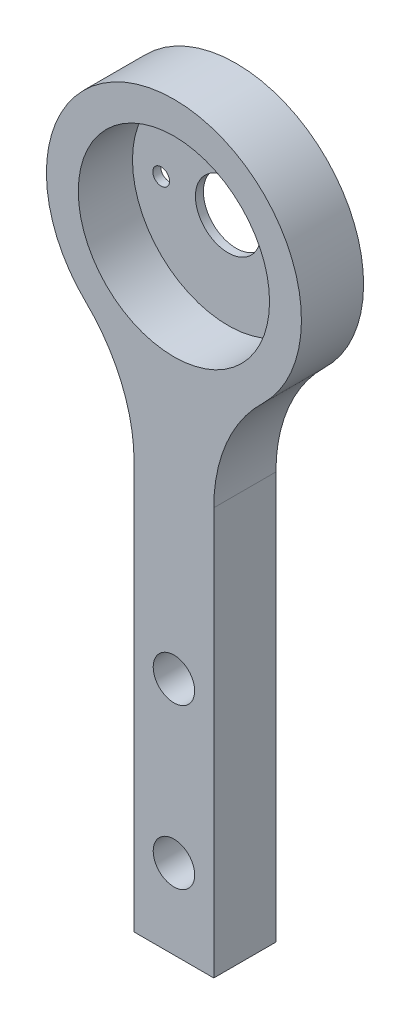
ISO-10303-21;
HEADER;
FILE_DESCRIPTION(('STEP AP214'),'2;1');
FILE_NAME('part.step','',(''),(''),'','','');
FILE_SCHEMA(('AUTOMOTIVE_DESIGN { 1 0 10303 214 1 1 1 1 }'));
ENDSEC;
DATA;
#1=APPLICATION_CONTEXT('core data for automotive mechanical design processes');
#2=APPLICATION_PROTOCOL_DEFINITION('international standard','automotive_design',2000,#1);
#3=PRODUCT_CONTEXT('',#1,'mechanical');
#4=PRODUCT('Part','Part','',(#3));
#5=PRODUCT_RELATED_PRODUCT_CATEGORY('part','',(#4));
#6=PRODUCT_DEFINITION_FORMATION('','',#4);
#7=PRODUCT_DEFINITION_CONTEXT('part definition',#1,'design');
#8=PRODUCT_DEFINITION('design','',#6,#7);
#9=PRODUCT_DEFINITION_SHAPE('','',#8);
#10=(LENGTH_UNIT() NAMED_UNIT(*) SI_UNIT(.MILLI.,.METRE.));
#11=(NAMED_UNIT(*) PLANE_ANGLE_UNIT() SI_UNIT($,.RADIAN.));
#12=(NAMED_UNIT(*) SI_UNIT($,.STERADIAN.) SOLID_ANGLE_UNIT());
#13=UNCERTAINTY_MEASURE_WITH_UNIT(LENGTH_MEASURE(1.E-05),#10,'distance_accuracy_value','');
#14=(GEOMETRIC_REPRESENTATION_CONTEXT(3) GLOBAL_UNCERTAINTY_ASSIGNED_CONTEXT((#13)) GLOBAL_UNIT_ASSIGNED_CONTEXT((#10,
#11,#12)) REPRESENTATION_CONTEXT('',''));
#15=CARTESIAN_POINT('',(0.,0.,0.));
#16=DIRECTION('',(0.,0.,1.));
#17=DIRECTION('',(1.,0.,0.));
#18=AXIS2_PLACEMENT_3D('',#15,#16,#17);
#19=CARTESIAN_POINT('',(0.,0.,3.9));
#20=DIRECTION('',(0.,0.,-1.));
#21=DIRECTION('',(-1.,0.,0.));
#22=AXIS2_PLACEMENT_3D('',#19,#20,#21);
#23=CYLINDRICAL_SURFACE('',#22,6.);
#24=CARTESIAN_POINT('',(0.,0.,3.9));
#25=DIRECTION('',(0.,0.,1.));
#26=DIRECTION('',(1.,0.,0.));
#27=AXIS2_PLACEMENT_3D('',#24,#25,#26);
#28=CIRCLE('',#27,6.);
#29=CARTESIAN_POINT('',(6.,0.,3.9));
#30=VERTEX_POINT('',#29);
#31=EDGE_CURVE('E126',#30,#30,#28,.T.);
#32=ORIENTED_EDGE('',*,*,#31,.T.);
#33=EDGE_LOOP('',(#32));
#34=FACE_BOUND('',#33,.T.);
#35=CARTESIAN_POINT('',(0.,0.,0.5));
#36=DIRECTION('',(0.,0.,-1.));
#37=DIRECTION('',(-1.,0.,0.));
#38=AXIS2_PLACEMENT_3D('',#35,#36,#37);
#39=CIRCLE('',#38,6.);
#40=CARTESIAN_POINT('',(-6.,0.,0.5));
#41=VERTEX_POINT('',#40);
#42=EDGE_CURVE('E40',#41,#41,#39,.T.);
#43=ORIENTED_EDGE('',*,*,#42,.T.);
#44=EDGE_LOOP('',(#43));
#45=FACE_BOUND('',#44,.T.);
#46=ADVANCED_FACE('F36',(#34,#45),#23,.F.);
#47=CARTESIAN_POINT('',(-12.5,-12.9518338469886,3.9));
#48=DIRECTION('',(0.,0.,-1.));
#49=DIRECTION('',(-1.,0.,0.));
#50=AXIS2_PLACEMENT_3D('',#47,#48,#49);
#51=PLANE('',#50);
#52=CARTESIAN_POINT('',(0.,-33.5,3.9));
#53=DIRECTION('',(0.,0.,-1.));
#54=DIRECTION('',(-1.,0.,0.));
#55=AXIS2_PLACEMENT_3D('',#52,#53,#54);
#56=CIRCLE('',#55,1.3);
#57=CARTESIAN_POINT('',(-1.29999999999999,-33.5,3.9));
#58=VERTEX_POINT('',#57);
#59=EDGE_CURVE('E188',#58,#58,#56,.T.);
#60=ORIENTED_EDGE('',*,*,#59,.T.);
#61=EDGE_LOOP('',(#60));
#62=FACE_BOUND('',#61,.T.);
#63=CARTESIAN_POINT('',(0.,-23.5,3.9));
#64=DIRECTION('',(0.,0.,-1.));
#65=DIRECTION('',(-1.,0.,0.));
#66=AXIS2_PLACEMENT_3D('',#63,#64,#65);
#67=CIRCLE('',#66,1.3);
#68=CARTESIAN_POINT('',(-1.29999999999999,-23.5,3.9));
#69=VERTEX_POINT('',#68);
#70=EDGE_CURVE('E191',#69,#69,#67,.T.);
#71=ORIENTED_EDGE('',*,*,#70,.T.);
#72=EDGE_LOOP('',(#71));
#73=FACE_BOUND('',#72,.T.);
#74=DIRECTION('',(0.,1.,0.));
#75=VECTOR('',#74,1.);
#76=CARTESIAN_POINT('',(2.5,-12.9518338469886,3.9));
#77=LINE('',#76,#75);
#78=CARTESIAN_POINT('',(2.5,-38.5,3.9));
#79=VERTEX_POINT('',#78);
#80=CARTESIAN_POINT('',(2.5,-12.9518338469886,3.9));
#81=VERTEX_POINT('',#80);
#82=EDGE_CURVE('E135',#79,#81,#77,.T.);
#83=ORIENTED_EDGE('',*,*,#82,.T.);
#84=CARTESIAN_POINT('',(12.5,-12.9518338469886,3.9));
#85=DIRECTION('',(0.,0.,-1.));
#86=DIRECTION('',(1.,0.,0.));
#87=AXIS2_PLACEMENT_3D('',#84,#85,#86);
#88=CIRCLE('',#87,10.);
#89=CARTESIAN_POINT('',(5.55555555555555,-5.75637059866161,3.9));
#90=VERTEX_POINT('',#89);
#91=EDGE_CURVE('E91',#81,#90,#88,.T.);
#92=ORIENTED_EDGE('',*,*,#91,.T.);
#93=CARTESIAN_POINT('',(0.,0.,3.9));
#94=DIRECTION('',(0.,0.,1.));
#95=DIRECTION('',(1.,0.,0.));
#96=AXIS2_PLACEMENT_3D('',#93,#94,#95);
#97=CIRCLE('',#96,8.);
#98=CARTESIAN_POINT('',(-5.55555555555556,-5.75637059866161,3.9));
#99=VERTEX_POINT('',#98);
#100=EDGE_CURVE('E105',#90,#99,#97,.T.);
#101=ORIENTED_EDGE('',*,*,#100,.T.);
#102=CARTESIAN_POINT('',(-12.5,-12.9518338469886,3.9));
#103=DIRECTION('',(0.,0.,-1.));
#104=DIRECTION('',(-1.,0.,0.));
#105=AXIS2_PLACEMENT_3D('',#102,#103,#104);
#106=CIRCLE('',#105,10.);
#107=CARTESIAN_POINT('',(-2.5,-12.9518338469886,3.9));
#108=VERTEX_POINT('',#107);
#109=EDGE_CURVE('E98',#99,#108,#106,.T.);
#110=ORIENTED_EDGE('',*,*,#109,.T.);
#111=DIRECTION('',(0.,-1.,0.));
#112=VECTOR('',#111,1.);
#113=CARTESIAN_POINT('',(-2.5,-12.9518338469886,3.9));
#114=LINE('',#113,#112);
#115=CARTESIAN_POINT('',(-2.5,-38.5,3.9));
#116=VERTEX_POINT('',#115);
#117=EDGE_CURVE('E103',#108,#116,#114,.T.);
#118=ORIENTED_EDGE('',*,*,#117,.T.);
#119=DIRECTION('',(1.,0.,0.));
#120=VECTOR('',#119,1.);
#121=CARTESIAN_POINT('',(-2.5,-38.5,3.9));
#122=LINE('',#121,#120);
#123=EDGE_CURVE('E54',#116,#79,#122,.T.);
#124=ORIENTED_EDGE('',*,*,#123,.T.);
#125=EDGE_LOOP('',(#83,#92,#101,#110,#118,#124));
#126=FACE_BOUND('',#125,.T.);
#127=ORIENTED_EDGE('',*,*,#31,.F.);
#128=EDGE_LOOP('',(#127));
#129=FACE_BOUND('',#128,.T.);
#130=ADVANCED_FACE('F100',(#62,#73,#126,#129),#51,.F.);
#131=CARTESIAN_POINT('',(-12.5,-12.9518338469886,0.));
#132=DIRECTION('',(0.,0.,-1.));
#133=DIRECTION('',(-1.,0.,0.));
#134=AXIS2_PLACEMENT_3D('',#131,#132,#133);
#135=PLANE('',#134);
#136=CARTESIAN_POINT('',(0.,-33.5,0.));
#137=DIRECTION('',(0.,0.,-1.));
#138=DIRECTION('',(-1.,0.,0.));
#139=AXIS2_PLACEMENT_3D('',#136,#137,#138);
#140=CIRCLE('',#139,2.2);
#141=CARTESIAN_POINT('',(-2.19999999999999,-33.5,0.));
#142=VERTEX_POINT('',#141);
#143=EDGE_CURVE('E182',#142,#142,#140,.T.);
#144=ORIENTED_EDGE('',*,*,#143,.F.);
#145=EDGE_LOOP('',(#144));
#146=FACE_BOUND('',#145,.T.);
#147=CARTESIAN_POINT('',(0.,-23.5,0.));
#148=DIRECTION('',(0.,0.,-1.));
#149=DIRECTION('',(-1.,0.,0.));
#150=AXIS2_PLACEMENT_3D('',#147,#148,#149);
#151=CIRCLE('',#150,2.2);
#152=CARTESIAN_POINT('',(-2.2,-23.5,0.));
#153=VERTEX_POINT('',#152);
#154=EDGE_CURVE('E185',#153,#153,#151,.T.);
#155=ORIENTED_EDGE('',*,*,#154,.F.);
#156=EDGE_LOOP('',(#155));
#157=FACE_BOUND('',#156,.T.);
#158=CARTESIAN_POINT('',(-12.5,-12.9518338469886,0.));
#159=DIRECTION('',(0.,0.,-1.));
#160=DIRECTION('',(-1.,0.,0.));
#161=AXIS2_PLACEMENT_3D('',#158,#159,#160);
#162=CIRCLE('',#161,10.);
#163=CARTESIAN_POINT('',(-5.55555555555556,-5.75637059866161,0.));
#164=VERTEX_POINT('',#163);
#165=CARTESIAN_POINT('',(-2.5,-12.9518338469886,0.));
#166=VERTEX_POINT('',#165);
#167=EDGE_CURVE('E112',#164,#166,#162,.T.);
#168=ORIENTED_EDGE('',*,*,#167,.F.);
#169=CARTESIAN_POINT('',(0.,0.,0.));
#170=DIRECTION('',(0.,0.,1.));
#171=DIRECTION('',(1.,0.,0.));
#172=AXIS2_PLACEMENT_3D('',#169,#170,#171);
#173=CIRCLE('',#172,8.);
#174=CARTESIAN_POINT('',(5.55555555555555,-5.75637059866161,0.));
#175=VERTEX_POINT('',#174);
#176=EDGE_CURVE('E129',#175,#164,#173,.T.);
#177=ORIENTED_EDGE('',*,*,#176,.F.);
#178=CARTESIAN_POINT('',(12.5,-12.9518338469886,0.));
#179=DIRECTION('',(0.,0.,-1.));
#180=DIRECTION('',(1.,0.,0.));
#181=AXIS2_PLACEMENT_3D('',#178,#179,#180);
#182=CIRCLE('',#181,10.);
#183=CARTESIAN_POINT('',(2.5,-12.9518338469886,0.));
#184=VERTEX_POINT('',#183);
#185=EDGE_CURVE('E125',#184,#175,#182,.T.);
#186=ORIENTED_EDGE('',*,*,#185,.F.);
#187=DIRECTION('',(0.,1.,0.));
#188=VECTOR('',#187,1.);
#189=CARTESIAN_POINT('',(2.5,-12.9518338469886,0.));
#190=LINE('',#189,#188);
#191=CARTESIAN_POINT('',(2.5,-38.5,0.));
#192=VERTEX_POINT('',#191);
#193=EDGE_CURVE('E122',#192,#184,#190,.T.);
#194=ORIENTED_EDGE('',*,*,#193,.F.);
#195=DIRECTION('',(1.,0.,0.));
#196=VECTOR('',#195,1.);
#197=CARTESIAN_POINT('',(-2.5,-38.5,0.));
#198=LINE('',#197,#196);
#199=CARTESIAN_POINT('',(-2.5,-38.5,0.));
#200=VERTEX_POINT('',#199);
#201=EDGE_CURVE('E83',#200,#192,#198,.T.);
#202=ORIENTED_EDGE('',*,*,#201,.F.);
#203=DIRECTION('',(0.,-1.,0.));
#204=VECTOR('',#203,1.);
#205=CARTESIAN_POINT('',(-2.5,-12.9518338469886,0.));
#206=LINE('',#205,#204);
#207=EDGE_CURVE('E77',#166,#200,#206,.T.);
#208=ORIENTED_EDGE('',*,*,#207,.F.);
#209=EDGE_LOOP('',(#168,#177,#186,#194,#202,#208));
#210=FACE_BOUND('',#209,.T.);
#211=CARTESIAN_POINT('',(0.,0.,0.));
#212=DIRECTION('',(0.,0.,-1.));
#213=DIRECTION('',(-1.,0.,0.));
#214=AXIS2_PLACEMENT_3D('',#211,#212,#213);
#215=CIRCLE('',#214,2.05);
#216=CARTESIAN_POINT('',(-2.05,0.,0.));
#217=VERTEX_POINT('',#216);
#218=EDGE_CURVE('E210',#217,#217,#215,.T.);
#219=ORIENTED_EDGE('',*,*,#218,.F.);
#220=EDGE_LOOP('',(#219));
#221=FACE_BOUND('',#220,.T.);
#222=CARTESIAN_POINT('',(-4.2,0.,0.));
#223=DIRECTION('',(0.,0.,-1.));
#224=DIRECTION('',(-1.,0.,0.));
#225=AXIS2_PLACEMENT_3D('',#222,#223,#224);
#226=CIRCLE('',#225,0.525);
#227=CARTESIAN_POINT('',(-4.725,0.,0.));
#228=VERTEX_POINT('',#227);
#229=EDGE_CURVE('E204',#228,#228,#226,.T.);
#230=ORIENTED_EDGE('',*,*,#229,.F.);
#231=EDGE_LOOP('',(#230));
#232=FACE_BOUND('',#231,.T.);
#233=CARTESIAN_POINT('',(4.2,0.,0.));
#234=DIRECTION('',(0.,0.,-1.));
#235=DIRECTION('',(-1.,0.,0.));
#236=AXIS2_PLACEMENT_3D('',#233,#234,#235);
#237=CIRCLE('',#236,0.525);
#238=CARTESIAN_POINT('',(3.675,0.,0.));
#239=VERTEX_POINT('',#238);
#240=EDGE_CURVE('E200',#239,#239,#237,.T.);
#241=ORIENTED_EDGE('',*,*,#240,.F.);
#242=EDGE_LOOP('',(#241));
#243=FACE_BOUND('',#242,.T.);
#244=ADVANCED_FACE('F146',(#146,#157,#210,#221,#232,#243),#135,.T.);
#245=CARTESIAN_POINT('',(2.5,-12.9518338469886,3.9));
#246=DIRECTION('',(-1.,0.,0.));
#247=DIRECTION('',(0.,-1.,0.));
#248=AXIS2_PLACEMENT_3D('',#245,#246,#247);
#249=PLANE('',#248);
#250=ORIENTED_EDGE('',*,*,#193,.T.);
#251=DIRECTION('',(0.,0.,-1.));
#252=VECTOR('',#251,1.);
#253=CARTESIAN_POINT('',(2.5,-12.9518338469886,3.9));
#254=LINE('',#253,#252);
#255=EDGE_CURVE('E11',#81,#184,#254,.T.);
#256=ORIENTED_EDGE('',*,*,#255,.F.);
#257=ORIENTED_EDGE('',*,*,#82,.F.);
#258=DIRECTION('',(0.,0.,-1.));
#259=VECTOR('',#258,1.);
#260=CARTESIAN_POINT('',(2.5,-38.5,3.9));
#261=LINE('',#260,#259);
#262=EDGE_CURVE('E118',#79,#192,#261,.T.);
#263=ORIENTED_EDGE('',*,*,#262,.T.);
#264=EDGE_LOOP('',(#250,#256,#257,#263));
#265=FACE_BOUND('',#264,.T.);
#266=ADVANCED_FACE('F38',(#265),#249,.F.);
#267=CARTESIAN_POINT('',(12.5,-12.9518338469886,3.9));
#268=DIRECTION('',(0.,0.,-1.));
#269=DIRECTION('',(-1.,0.,0.));
#270=AXIS2_PLACEMENT_3D('',#267,#268,#269);
#271=CYLINDRICAL_SURFACE('',#270,10.);
#272=ORIENTED_EDGE('',*,*,#185,.T.);
#273=DIRECTION('',(0.,0.,-1.));
#274=VECTOR('',#273,1.);
#275=CARTESIAN_POINT('',(5.55555555555555,-5.75637059866161,3.9));
#276=LINE('',#275,#274);
#277=EDGE_CURVE('E46',#90,#175,#276,.T.);
#278=ORIENTED_EDGE('',*,*,#277,.F.);
#279=ORIENTED_EDGE('',*,*,#91,.F.);
#280=ORIENTED_EDGE('',*,*,#255,.T.);
#281=EDGE_LOOP('',(#272,#278,#279,#280));
#282=FACE_BOUND('',#281,.T.);
#283=ADVANCED_FACE('F142',(#282),#271,.F.);
#284=CARTESIAN_POINT('',(0.,0.,3.9));
#285=DIRECTION('',(0.,0.,-1.));
#286=DIRECTION('',(-1.,0.,0.));
#287=AXIS2_PLACEMENT_3D('',#284,#285,#286);
#288=CYLINDRICAL_SURFACE('',#287,8.);
#289=ORIENTED_EDGE('',*,*,#176,.T.);
#290=DIRECTION('',(0.,0.,-1.));
#291=VECTOR('',#290,1.);
#292=CARTESIAN_POINT('',(-5.55555555555556,-5.75637059866161,3.9));
#293=LINE('',#292,#291);
#294=EDGE_CURVE('E113',#99,#164,#293,.T.);
#295=ORIENTED_EDGE('',*,*,#294,.F.);
#296=ORIENTED_EDGE('',*,*,#100,.F.);
#297=ORIENTED_EDGE('',*,*,#277,.T.);
#298=EDGE_LOOP('',(#289,#295,#296,#297));
#299=FACE_BOUND('',#298,.T.);
#300=ADVANCED_FACE('F140',(#299),#288,.T.);
#301=CARTESIAN_POINT('',(-12.5,-12.9518338469886,3.9));
#302=DIRECTION('',(0.,0.,-1.));
#303=DIRECTION('',(-1.,0.,0.));
#304=AXIS2_PLACEMENT_3D('',#301,#302,#303);
#305=CYLINDRICAL_SURFACE('',#304,10.);
#306=ORIENTED_EDGE('',*,*,#167,.T.);
#307=DIRECTION('',(0.,0.,-1.));
#308=VECTOR('',#307,1.);
#309=CARTESIAN_POINT('',(-2.5,-12.9518338469886,3.9));
#310=LINE('',#309,#308);
#311=EDGE_CURVE('E109',#108,#166,#310,.T.);
#312=ORIENTED_EDGE('',*,*,#311,.F.);
#313=ORIENTED_EDGE('',*,*,#109,.F.);
#314=ORIENTED_EDGE('',*,*,#294,.T.);
#315=EDGE_LOOP('',(#306,#312,#313,#314));
#316=FACE_BOUND('',#315,.T.);
#317=ADVANCED_FACE('F110',(#316),#305,.F.);
#318=CARTESIAN_POINT('',(-2.5,-12.9518338469886,3.9));
#319=DIRECTION('',(1.,0.,0.));
#320=DIRECTION('',(0.,1.,0.));
#321=AXIS2_PLACEMENT_3D('',#318,#319,#320);
#322=PLANE('',#321);
#323=ORIENTED_EDGE('',*,*,#207,.T.);
#324=DIRECTION('',(0.,0.,-1.));
#325=VECTOR('',#324,1.);
#326=CARTESIAN_POINT('',(-2.5,-38.5,3.9));
#327=LINE('',#326,#325);
#328=EDGE_CURVE('E114',#116,#200,#327,.T.);
#329=ORIENTED_EDGE('',*,*,#328,.F.);
#330=ORIENTED_EDGE('',*,*,#117,.F.);
#331=ORIENTED_EDGE('',*,*,#311,.T.);
#332=EDGE_LOOP('',(#323,#329,#330,#331));
#333=FACE_BOUND('',#332,.T.);
#334=ADVANCED_FACE('F116',(#333),#322,.F.);
#335=CARTESIAN_POINT('',(-2.5,-38.5,3.9));
#336=DIRECTION('',(0.,1.,0.));
#337=DIRECTION('',(0.,0.,1.));
#338=AXIS2_PLACEMENT_3D('',#335,#336,#337);
#339=PLANE('',#338);
#340=ORIENTED_EDGE('',*,*,#201,.T.);
#341=ORIENTED_EDGE('',*,*,#262,.F.);
#342=ORIENTED_EDGE('',*,*,#123,.F.);
#343=ORIENTED_EDGE('',*,*,#328,.T.);
#344=EDGE_LOOP('',(#340,#341,#342,#343));
#345=FACE_BOUND('',#344,.T.);
#346=ADVANCED_FACE('F150',(#345),#339,.F.);
#347=CARTESIAN_POINT('',(0.,0.,0.5));
#348=DIRECTION('',(0.,0.,-1.));
#349=DIRECTION('',(-1.,0.,0.));
#350=AXIS2_PLACEMENT_3D('',#347,#348,#349);
#351=PLANE('',#350);
#352=CARTESIAN_POINT('',(0.,0.,0.5));
#353=DIRECTION('',(0.,0.,-1.));
#354=DIRECTION('',(-1.,0.,0.));
#355=AXIS2_PLACEMENT_3D('',#352,#353,#354);
#356=CIRCLE('',#355,2.05);
#357=CARTESIAN_POINT('',(-2.05,0.,0.5));
#358=VERTEX_POINT('',#357);
#359=EDGE_CURVE('E213',#358,#358,#356,.T.);
#360=ORIENTED_EDGE('',*,*,#359,.T.);
#361=EDGE_LOOP('',(#360));
#362=FACE_BOUND('',#361,.T.);
#363=CARTESIAN_POINT('',(-4.2,0.,0.5));
#364=DIRECTION('',(0.,0.,-1.));
#365=DIRECTION('',(-1.,0.,0.));
#366=AXIS2_PLACEMENT_3D('',#363,#364,#365);
#367=CIRCLE('',#366,0.525);
#368=CARTESIAN_POINT('',(-4.725,0.,0.5));
#369=VERTEX_POINT('',#368);
#370=EDGE_CURVE('E207',#369,#369,#367,.T.);
#371=ORIENTED_EDGE('',*,*,#370,.T.);
#372=EDGE_LOOP('',(#371));
#373=FACE_BOUND('',#372,.T.);
#374=CARTESIAN_POINT('',(4.2,0.,0.5));
#375=DIRECTION('',(0.,0.,-1.));
#376=DIRECTION('',(-1.,0.,0.));
#377=AXIS2_PLACEMENT_3D('',#374,#375,#376);
#378=CIRCLE('',#377,0.525);
#379=CARTESIAN_POINT('',(3.675,0.,0.5));
#380=VERTEX_POINT('',#379);
#381=EDGE_CURVE('E201',#380,#380,#378,.T.);
#382=ORIENTED_EDGE('',*,*,#381,.T.);
#383=EDGE_LOOP('',(#382));
#384=FACE_BOUND('',#383,.T.);
#385=ORIENTED_EDGE('',*,*,#42,.F.);
#386=EDGE_LOOP('',(#385));
#387=FACE_BOUND('',#386,.T.);
#388=ADVANCED_FACE('F152',(#362,#373,#384,#387),#351,.F.);
#389=CARTESIAN_POINT('',(0.,0.,0.5));
#390=DIRECTION('',(0.,0.,-1.));
#391=DIRECTION('',(-1.,0.,0.));
#392=AXIS2_PLACEMENT_3D('',#389,#390,#391);
#393=CYLINDRICAL_SURFACE('',#392,2.05);
#394=ORIENTED_EDGE('',*,*,#359,.F.);
#395=EDGE_LOOP('',(#394));
#396=FACE_BOUND('',#395,.T.);
#397=ORIENTED_EDGE('',*,*,#218,.T.);
#398=EDGE_LOOP('',(#397));
#399=FACE_BOUND('',#398,.T.);
#400=ADVANCED_FACE('F158',(#396,#399),#393,.F.);
#401=CARTESIAN_POINT('',(-4.2,0.,0.5));
#402=DIRECTION('',(0.,0.,-1.));
#403=DIRECTION('',(-1.,0.,0.));
#404=AXIS2_PLACEMENT_3D('',#401,#402,#403);
#405=CYLINDRICAL_SURFACE('',#404,0.525);
#406=ORIENTED_EDGE('',*,*,#370,.F.);
#407=EDGE_LOOP('',(#406));
#408=FACE_BOUND('',#407,.T.);
#409=ORIENTED_EDGE('',*,*,#229,.T.);
#410=EDGE_LOOP('',(#409));
#411=FACE_BOUND('',#410,.T.);
#412=ADVANCED_FACE('F234',(#408,#411),#405,.F.);
#413=CARTESIAN_POINT('',(4.2,0.,0.5));
#414=DIRECTION('',(0.,0.,-1.));
#415=DIRECTION('',(-1.,0.,0.));
#416=AXIS2_PLACEMENT_3D('',#413,#414,#415);
#417=CYLINDRICAL_SURFACE('',#416,0.525);
#418=ORIENTED_EDGE('',*,*,#381,.F.);
#419=EDGE_LOOP('',(#418));
#420=FACE_BOUND('',#419,.T.);
#421=ORIENTED_EDGE('',*,*,#240,.T.);
#422=EDGE_LOOP('',(#421));
#423=FACE_BOUND('',#422,.T.);
#424=ADVANCED_FACE('F231',(#420,#423),#417,.F.);
#425=CARTESIAN_POINT('',(0.,-23.5,0.));
#426=DIRECTION('',(0.,0.,-1.));
#427=DIRECTION('',(-1.,0.,0.));
#428=AXIS2_PLACEMENT_3D('',#425,#426,#427);
#429=CYLINDRICAL_SURFACE('',#428,1.29999999999999);
#430=ORIENTED_EDGE('',*,*,#70,.F.);
#431=EDGE_LOOP('',(#430));
#432=FACE_BOUND('',#431,.T.);
#433=CARTESIAN_POINT('',(0.,-23.5,0.899999999999998));
#434=DIRECTION('',(0.,0.,-1.));
#435=DIRECTION('',(-1.,0.,0.));
#436=AXIS2_PLACEMENT_3D('',#433,#434,#435);
#437=CIRCLE('',#436,1.29999999999999);
#438=CARTESIAN_POINT('',(-1.29999999999998,-23.5,0.899999999999998));
#439=VERTEX_POINT('',#438);
#440=EDGE_CURVE('E187',#439,#439,#437,.T.);
#441=ORIENTED_EDGE('',*,*,#440,.T.);
#442=EDGE_LOOP('',(#441));
#443=FACE_BOUND('',#442,.T.);
#444=ADVANCED_FACE('F233',(#432,#443),#429,.F.);
#445=CARTESIAN_POINT('',(0.,-23.5,0.));
#446=DIRECTION('',(0.,0.,-1.));
#447=DIRECTION('',(-1.,0.,0.));
#448=AXIS2_PLACEMENT_3D('',#445,#446,#447);
#449=CONICAL_SURFACE('',#448,2.2,0.785398163397455);
#450=ORIENTED_EDGE('',*,*,#440,.F.);
#451=EDGE_LOOP('',(#450));
#452=FACE_BOUND('',#451,.T.);
#453=ORIENTED_EDGE('',*,*,#154,.T.);
#454=EDGE_LOOP('',(#453));
#455=FACE_BOUND('',#454,.T.);
#456=ADVANCED_FACE('F241',(#452,#455),#449,.F.);
#457=CARTESIAN_POINT('',(0.,-33.5,0.));
#458=DIRECTION('',(0.,0.,-1.));
#459=DIRECTION('',(-1.,0.,0.));
#460=AXIS2_PLACEMENT_3D('',#457,#458,#459);
#461=CYLINDRICAL_SURFACE('',#460,1.29999999999999);
#462=ORIENTED_EDGE('',*,*,#59,.F.);
#463=EDGE_LOOP('',(#462));
#464=FACE_BOUND('',#463,.T.);
#465=CARTESIAN_POINT('',(0.,-33.5,0.899999999999998));
#466=DIRECTION('',(0.,0.,-1.));
#467=DIRECTION('',(-1.,0.,0.));
#468=AXIS2_PLACEMENT_3D('',#465,#466,#467);
#469=CIRCLE('',#468,1.29999999999999);
#470=CARTESIAN_POINT('',(-1.29999999999998,-33.5,0.899999999999998));
#471=VERTEX_POINT('',#470);
#472=EDGE_CURVE('E194',#471,#471,#469,.T.);
#473=ORIENTED_EDGE('',*,*,#472,.T.);
#474=EDGE_LOOP('',(#473));
#475=FACE_BOUND('',#474,.T.);
#476=ADVANCED_FACE('F295',(#464,#475),#461,.F.);
#477=CARTESIAN_POINT('',(0.,-33.5,0.));
#478=DIRECTION('',(0.,0.,-1.));
#479=DIRECTION('',(-1.,0.,0.));
#480=AXIS2_PLACEMENT_3D('',#477,#478,#479);
#481=CONICAL_SURFACE('',#480,2.2,0.785398163397455);
#482=ORIENTED_EDGE('',*,*,#472,.F.);
#483=EDGE_LOOP('',(#482));
#484=FACE_BOUND('',#483,.T.);
#485=ORIENTED_EDGE('',*,*,#143,.T.);
#486=EDGE_LOOP('',(#485));
#487=FACE_BOUND('',#486,.T.);
#488=ADVANCED_FACE('F304',(#484,#487),#481,.F.);
#489=CLOSED_SHELL('',(#46,#130,#244,#266,#283,#300,#317,#334,#346,#388,#400,#412,#424,#444,#456,
#476,#488));
#490=MANIFOLD_SOLID_BREP('B2',#489);
#491=ADVANCED_BREP_SHAPE_REPRESENTATION('',(#18,#490),#14);
#492=SHAPE_DEFINITION_REPRESENTATION(#9,#491);
ENDSEC;
END-ISO-10303-21;
